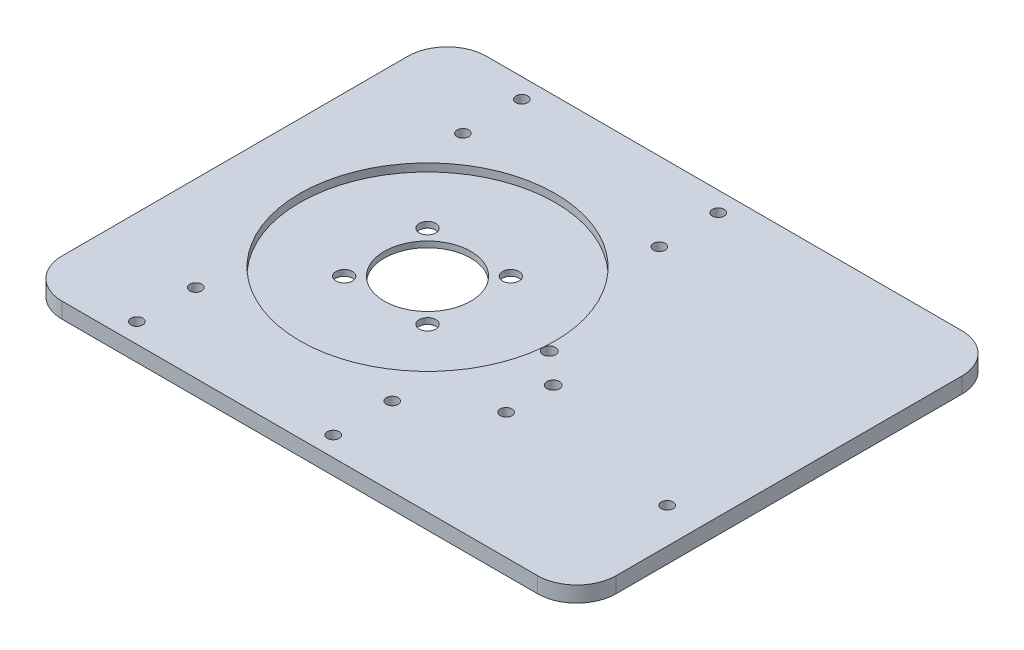
ISO-10303-21;
HEADER;
FILE_DESCRIPTION(('STEP AP214'),'2;1');
FILE_NAME('part.step','',(''),(''),'','','');
FILE_SCHEMA(('AUTOMOTIVE_DESIGN { 1 0 10303 214 1 1 1 1 }'));
ENDSEC;
DATA;
#1=APPLICATION_CONTEXT('core data for automotive mechanical design processes');
#2=APPLICATION_PROTOCOL_DEFINITION('international standard','automotive_design',2000,#1);
#3=PRODUCT_CONTEXT('',#1,'mechanical');
#4=PRODUCT('Part','Part','',(#3));
#5=PRODUCT_RELATED_PRODUCT_CATEGORY('part','',(#4));
#6=PRODUCT_DEFINITION_FORMATION('','',#4);
#7=PRODUCT_DEFINITION_CONTEXT('part definition',#1,'design');
#8=PRODUCT_DEFINITION('design','',#6,#7);
#9=PRODUCT_DEFINITION_SHAPE('','',#8);
#10=(LENGTH_UNIT() NAMED_UNIT(*) SI_UNIT(.MILLI.,.METRE.));
#11=(NAMED_UNIT(*) PLANE_ANGLE_UNIT() SI_UNIT($,.RADIAN.));
#12=(NAMED_UNIT(*) SI_UNIT($,.STERADIAN.) SOLID_ANGLE_UNIT());
#13=UNCERTAINTY_MEASURE_WITH_UNIT(LENGTH_MEASURE(1.E-05),#10,'distance_accuracy_value','');
#14=(GEOMETRIC_REPRESENTATION_CONTEXT(3) GLOBAL_UNCERTAINTY_ASSIGNED_CONTEXT((#13)) GLOBAL_UNIT_ASSIGNED_CONTEXT((#10,
#11,#12)) REPRESENTATION_CONTEXT('',''));
#15=CARTESIAN_POINT('',(0.,0.,0.));
#16=DIRECTION('',(0.,0.,1.));
#17=DIRECTION('',(1.,0.,0.));
#18=AXIS2_PLACEMENT_3D('',#15,#16,#17);
#19=CARTESIAN_POINT('',(237.616141789,-293.147680018,0.));
#20=DIRECTION('',(0.,1.,0.));
#21=DIRECTION('',(0.,0.,1.));
#22=AXIS2_PLACEMENT_3D('',#19,#20,#21);
#23=PLANE('',#22);
#24=CARTESIAN_POINT('',(237.616141789,-293.147680018,0.));
#25=DIRECTION('',(0.,1.,0.));
#26=DIRECTION('',(0.,0.,1.));
#27=AXIS2_PLACEMENT_3D('',#24,#25,#26);
#28=CIRCLE('',#27,11.);
#29=CARTESIAN_POINT('',(237.616141789,-293.147680018,11.));
#30=VERTEX_POINT('',#29);
#31=EDGE_CURVE('E237',#30,#30,#28,.F.);
#32=ORIENTED_EDGE('',*,*,#31,.T.);
#33=EDGE_LOOP('',(#32));
#34=FACE_BOUND('',#33,.T.);
#35=CARTESIAN_POINT('',(248.222743506798,-293.147680018,10.6066017177982));
#36=DIRECTION('',(0.,1.,0.));
#37=DIRECTION('',(0.,0.,1.));
#38=AXIS2_PLACEMENT_3D('',#35,#36,#37);
#39=CIRCLE('',#38,2.09999999999999);
#40=CARTESIAN_POINT('',(248.222743506798,-293.147680018,12.7066017177982));
#41=VERTEX_POINT('',#40);
#42=EDGE_CURVE('E240',#41,#41,#39,.F.);
#43=ORIENTED_EDGE('',*,*,#42,.T.);
#44=EDGE_LOOP('',(#43));
#45=FACE_BOUND('',#44,.T.);
#46=CARTESIAN_POINT('',(227.009540071202,-293.147680018,-10.6066017177981));
#47=DIRECTION('',(0.,1.,0.));
#48=DIRECTION('',(0.,0.,1.));
#49=AXIS2_PLACEMENT_3D('',#46,#47,#48);
#50=CIRCLE('',#49,2.09999999999999);
#51=CARTESIAN_POINT('',(227.009540071202,-293.147680018,-8.5066017177981));
#52=VERTEX_POINT('',#51);
#53=EDGE_CURVE('E243',#52,#52,#50,.F.);
#54=ORIENTED_EDGE('',*,*,#53,.T.);
#55=EDGE_LOOP('',(#54));
#56=FACE_BOUND('',#55,.T.);
#57=CARTESIAN_POINT('',(237.616141789,-293.147680018,0.));
#58=DIRECTION('',(0.,1.,0.));
#59=DIRECTION('',(0.,0.,1.));
#60=AXIS2_PLACEMENT_3D('',#57,#58,#59);
#61=CIRCLE('',#60,32.5);
#62=CARTESIAN_POINT('',(237.616141789,-293.147680018,32.5));
#63=VERTEX_POINT('',#62);
#64=EDGE_CURVE('E234',#63,#63,#61,.T.);
#65=ORIENTED_EDGE('',*,*,#64,.T.);
#66=EDGE_LOOP('',(#65));
#67=FACE_BOUND('',#66,.T.);
#68=CARTESIAN_POINT('',(248.222743506798,-293.147680018,-10.6066017177982));
#69=DIRECTION('',(0.,1.,0.));
#70=DIRECTION('',(0.,0.,1.));
#71=AXIS2_PLACEMENT_3D('',#68,#69,#70);
#72=CIRCLE('',#71,2.09999999999999);
#73=CARTESIAN_POINT('',(248.222743506798,-293.147680018,-8.50660171779822));
#74=VERTEX_POINT('',#73);
#75=EDGE_CURVE('E245',#74,#74,#72,.F.);
#76=ORIENTED_EDGE('',*,*,#75,.T.);
#77=EDGE_LOOP('',(#76));
#78=FACE_BOUND('',#77,.T.);
#79=CARTESIAN_POINT('',(227.009540071202,-293.147680018,10.6066017177982));
#80=DIRECTION('',(0.,1.,0.));
#81=DIRECTION('',(0.,0.,1.));
#82=AXIS2_PLACEMENT_3D('',#79,#80,#81);
#83=CIRCLE('',#82,2.09999999999999);
#84=CARTESIAN_POINT('',(227.009540071202,-293.147680018,12.7066017177982));
#85=VERTEX_POINT('',#84);
#86=EDGE_CURVE('E20',#85,#85,#83,.F.);
#87=ORIENTED_EDGE('',*,*,#86,.T.);
#88=EDGE_LOOP('',(#87));
#89=FACE_BOUND('',#88,.T.);
#90=ADVANCED_FACE('F17',(#34,#45,#56,#67,#78,#89),#23,.T.);
#91=CARTESIAN_POINT('',(227.009540071202,-302.147680018,10.6066017177982));
#92=DIRECTION('',(0.,1.,0.));
#93=DIRECTION('',(0.,0.,1.));
#94=AXIS2_PLACEMENT_3D('',#91,#92,#93);
#95=CYLINDRICAL_SURFACE('',#94,2.09999999999999);
#96=ORIENTED_EDGE('',*,*,#86,.F.);
#97=EDGE_LOOP('',(#96));
#98=FACE_BOUND('',#97,.T.);
#99=CARTESIAN_POINT('',(227.009540071202,-294.647680018,10.6066017177982));
#100=DIRECTION('',(0.,1.,0.));
#101=DIRECTION('',(0.,0.,1.));
#102=AXIS2_PLACEMENT_3D('',#99,#100,#101);
#103=CIRCLE('',#102,2.09999999999999);
#104=CARTESIAN_POINT('',(227.009540071202,-294.647680018,12.7066017177982));
#105=VERTEX_POINT('',#104);
#106=EDGE_CURVE('E231',#105,#105,#103,.T.);
#107=ORIENTED_EDGE('',*,*,#106,.F.);
#108=EDGE_LOOP('',(#107));
#109=FACE_BOUND('',#108,.T.);
#110=ADVANCED_FACE('F253',(#98,#109),#95,.F.);
#111=CARTESIAN_POINT('',(248.222743506798,-302.147680018,-10.6066017177982));
#112=DIRECTION('',(0.,1.,0.));
#113=DIRECTION('',(0.,0.,1.));
#114=AXIS2_PLACEMENT_3D('',#111,#112,#113);
#115=CYLINDRICAL_SURFACE('',#114,2.09999999999999);
#116=ORIENTED_EDGE('',*,*,#75,.F.);
#117=EDGE_LOOP('',(#116));
#118=FACE_BOUND('',#117,.T.);
#119=CARTESIAN_POINT('',(248.222743506798,-294.647680018,-10.6066017177982));
#120=DIRECTION('',(0.,1.,0.));
#121=DIRECTION('',(0.,0.,1.));
#122=AXIS2_PLACEMENT_3D('',#119,#120,#121);
#123=CIRCLE('',#122,2.09999999999999);
#124=CARTESIAN_POINT('',(248.222743506798,-294.647680018,-8.50660171779822));
#125=VERTEX_POINT('',#124);
#126=EDGE_CURVE('E228',#125,#125,#123,.T.);
#127=ORIENTED_EDGE('',*,*,#126,.F.);
#128=EDGE_LOOP('',(#127));
#129=FACE_BOUND('',#128,.T.);
#130=ADVANCED_FACE('F256',(#118,#129),#115,.F.);
#131=CARTESIAN_POINT('',(227.009540071202,-302.147680018,-10.6066017177981));
#132=DIRECTION('',(0.,1.,0.));
#133=DIRECTION('',(0.,0.,1.));
#134=AXIS2_PLACEMENT_3D('',#131,#132,#133);
#135=CYLINDRICAL_SURFACE('',#134,2.09999999999999);
#136=ORIENTED_EDGE('',*,*,#53,.F.);
#137=EDGE_LOOP('',(#136));
#138=FACE_BOUND('',#137,.T.);
#139=CARTESIAN_POINT('',(227.009540071202,-294.647680018,-10.6066017177981));
#140=DIRECTION('',(0.,1.,0.));
#141=DIRECTION('',(0.,0.,1.));
#142=AXIS2_PLACEMENT_3D('',#139,#140,#141);
#143=CIRCLE('',#142,2.09999999999999);
#144=CARTESIAN_POINT('',(227.009540071202,-294.647680018,-8.5066017177981));
#145=VERTEX_POINT('',#144);
#146=EDGE_CURVE('E225',#145,#145,#143,.T.);
#147=ORIENTED_EDGE('',*,*,#146,.F.);
#148=EDGE_LOOP('',(#147));
#149=FACE_BOUND('',#148,.T.);
#150=ADVANCED_FACE('F371',(#138,#149),#135,.F.);
#151=CARTESIAN_POINT('',(248.222743506798,-302.147680018,10.6066017177982));
#152=DIRECTION('',(0.,1.,0.));
#153=DIRECTION('',(0.,0.,1.));
#154=AXIS2_PLACEMENT_3D('',#151,#152,#153);
#155=CYLINDRICAL_SURFACE('',#154,2.09999999999999);
#156=ORIENTED_EDGE('',*,*,#42,.F.);
#157=EDGE_LOOP('',(#156));
#158=FACE_BOUND('',#157,.T.);
#159=CARTESIAN_POINT('',(248.222743506798,-294.647680018,10.6066017177982));
#160=DIRECTION('',(0.,1.,0.));
#161=DIRECTION('',(0.,0.,1.));
#162=AXIS2_PLACEMENT_3D('',#159,#160,#161);
#163=CIRCLE('',#162,2.09999999999999);
#164=CARTESIAN_POINT('',(248.222743506798,-294.647680018,12.7066017177982));
#165=VERTEX_POINT('',#164);
#166=EDGE_CURVE('E222',#165,#165,#163,.T.);
#167=ORIENTED_EDGE('',*,*,#166,.F.);
#168=EDGE_LOOP('',(#167));
#169=FACE_BOUND('',#168,.T.);
#170=ADVANCED_FACE('F377',(#158,#169),#155,.F.);
#171=CARTESIAN_POINT('',(237.616141789,-302.147680018,0.));
#172=DIRECTION('',(0.,1.,0.));
#173=DIRECTION('',(0.,0.,1.));
#174=AXIS2_PLACEMENT_3D('',#171,#172,#173);
#175=CYLINDRICAL_SURFACE('',#174,11.);
#176=ORIENTED_EDGE('',*,*,#31,.F.);
#177=EDGE_LOOP('',(#176));
#178=FACE_BOUND('',#177,.T.);
#179=CARTESIAN_POINT('',(237.616141789,-294.647680018,0.));
#180=DIRECTION('',(0.,1.,0.));
#181=DIRECTION('',(0.,0.,1.));
#182=AXIS2_PLACEMENT_3D('',#179,#180,#181);
#183=CIRCLE('',#182,11.);
#184=CARTESIAN_POINT('',(237.616141789,-294.647680018,11.));
#185=VERTEX_POINT('',#184);
#186=EDGE_CURVE('E219',#185,#185,#183,.T.);
#187=ORIENTED_EDGE('',*,*,#186,.F.);
#188=EDGE_LOOP('',(#187));
#189=FACE_BOUND('',#188,.T.);
#190=ADVANCED_FACE('F272',(#178,#189),#175,.F.);
#191=CARTESIAN_POINT('',(237.616141789,-293.147680018,0.));
#192=DIRECTION('',(0.,1.,0.));
#193=DIRECTION('',(0.,0.,1.));
#194=AXIS2_PLACEMENT_3D('',#191,#192,#193);
#195=CYLINDRICAL_SURFACE('',#194,32.5);
#196=CARTESIAN_POINT('',(237.616141789,-291.147680018,0.));
#197=DIRECTION('',(0.,1.,0.));
#198=DIRECTION('',(0.,0.,1.));
#199=AXIS2_PLACEMENT_3D('',#196,#197,#198);
#200=CIRCLE('',#199,32.5);
#201=CARTESIAN_POINT('',(237.616141789,-291.147680018,32.5));
#202=VERTEX_POINT('',#201);
#203=EDGE_CURVE('E216',#202,#202,#200,.F.);
#204=ORIENTED_EDGE('',*,*,#203,.F.);
#205=EDGE_LOOP('',(#204));
#206=FACE_BOUND('',#205,.T.);
#207=ORIENTED_EDGE('',*,*,#64,.F.);
#208=EDGE_LOOP('',(#207));
#209=FACE_BOUND('',#208,.T.);
#210=ADVANCED_FACE('F261',(#206,#209),#195,.F.);
#211=CARTESIAN_POINT('',(237.616141789023,-294.647680018,-3.56312201965636E-11));
#212=DIRECTION('',(0.,-1.,0.));
#213=DIRECTION('',(0.,0.,-1.));
#214=AXIS2_PLACEMENT_3D('',#211,#212,#213);
#215=PLANE('',#214);
#216=ORIENTED_EDGE('',*,*,#186,.T.);
#217=EDGE_LOOP('',(#216));
#218=FACE_BOUND('',#217,.T.);
#219=ORIENTED_EDGE('',*,*,#166,.T.);
#220=EDGE_LOOP('',(#219));
#221=FACE_BOUND('',#220,.T.);
#222=ORIENTED_EDGE('',*,*,#146,.T.);
#223=EDGE_LOOP('',(#222));
#224=FACE_BOUND('',#223,.T.);
#225=CARTESIAN_POINT('',(237.616141789023,-294.647680018,-3.56312201965636E-11));
#226=DIRECTION('',(0.,-1.,0.));
#227=DIRECTION('',(0.,0.,-1.));
#228=AXIS2_PLACEMENT_3D('',#225,#226,#227);
#229=CIRCLE('',#228,20.5);
#230=CARTESIAN_POINT('',(237.616141789023,-294.647680018,-20.5000000000357));
#231=VERTEX_POINT('',#230);
#232=EDGE_CURVE('E213',#231,#231,#229,.T.);
#233=ORIENTED_EDGE('',*,*,#232,.T.);
#234=EDGE_LOOP('',(#233));
#235=FACE_BOUND('',#234,.T.);
#236=ORIENTED_EDGE('',*,*,#126,.T.);
#237=EDGE_LOOP('',(#236));
#238=FACE_BOUND('',#237,.T.);
#239=ORIENTED_EDGE('',*,*,#106,.T.);
#240=EDGE_LOOP('',(#239));
#241=FACE_BOUND('',#240,.T.);
#242=ADVANCED_FACE('F259',(#218,#221,#224,#235,#238,#241),#215,.T.);
#243=CARTESIAN_POINT('',(198.616141789,-291.147680018,43.9999999999999));
#244=DIRECTION('',(0.,1.,0.));
#245=DIRECTION('',(0.,0.,1.));
#246=AXIS2_PLACEMENT_3D('',#243,#244,#245);
#247=PLANE('',#246);
#248=CARTESIAN_POINT('',(279.616141789,-291.147680018,22.));
#249=DIRECTION('',(0.,-1.,0.));
#250=DIRECTION('',(0.,0.,-1.));
#251=AXIS2_PLACEMENT_3D('',#248,#249,#250);
#252=CIRCLE('',#251,1.49999999999997);
#253=CARTESIAN_POINT('',(279.616141789,-291.147680018,20.5));
#254=VERTEX_POINT('',#253);
#255=EDGE_CURVE('E207',#254,#254,#252,.T.);
#256=ORIENTED_EDGE('',*,*,#255,.T.);
#257=EDGE_LOOP('',(#256));
#258=FACE_BOUND('',#257,.T.);
#259=CARTESIAN_POINT('',(279.616141789,-291.147680018,9.99999999999996));
#260=DIRECTION('',(0.,-1.,0.));
#261=DIRECTION('',(0.,0.,-1.));
#262=AXIS2_PLACEMENT_3D('',#259,#260,#261);
#263=CIRCLE('',#262,1.59999999999996);
#264=CARTESIAN_POINT('',(279.616141789,-291.147680018,8.4));
#265=VERTEX_POINT('',#264);
#266=EDGE_CURVE('E180',#265,#265,#263,.T.);
#267=ORIENTED_EDGE('',*,*,#266,.T.);
#268=EDGE_LOOP('',(#267));
#269=FACE_BOUND('',#268,.T.);
#270=CARTESIAN_POINT('',(262.616141789,-291.147680018,34.));
#271=DIRECTION('',(0.,-1.,0.));
#272=DIRECTION('',(0.,0.,-1.));
#273=AXIS2_PLACEMENT_3D('',#270,#271,#272);
#274=CIRCLE('',#273,1.50000000000002);
#275=CARTESIAN_POINT('',(262.616141789,-291.147680018,32.5));
#276=VERTEX_POINT('',#275);
#277=EDGE_CURVE('E198',#276,#276,#274,.T.);
#278=ORIENTED_EDGE('',*,*,#277,.T.);
#279=EDGE_LOOP('',(#278));
#280=FACE_BOUND('',#279,.T.);
#281=CARTESIAN_POINT('',(212.616141789,-291.147680018,49.));
#282=DIRECTION('',(0.,-1.,0.));
#283=DIRECTION('',(0.,0.,-1.));
#284=AXIS2_PLACEMENT_3D('',#281,#282,#283);
#285=CIRCLE('',#284,1.50000000000003);
#286=CARTESIAN_POINT('',(212.616141789,-291.147680018,47.5));
#287=VERTEX_POINT('',#286);
#288=EDGE_CURVE('E201',#287,#287,#285,.T.);
#289=ORIENTED_EDGE('',*,*,#288,.T.);
#290=EDGE_LOOP('',(#289));
#291=FACE_BOUND('',#290,.T.);
#292=CARTESIAN_POINT('',(262.616141789,-291.147680018,-34.));
#293=DIRECTION('',(0.,-1.,0.));
#294=DIRECTION('',(0.,0.,-1.));
#295=AXIS2_PLACEMENT_3D('',#292,#293,#294);
#296=CIRCLE('',#295,1.50000000000008);
#297=CARTESIAN_POINT('',(262.616141789,-291.147680018,-35.5000000000001));
#298=VERTEX_POINT('',#297);
#299=EDGE_CURVE('E189',#298,#298,#296,.T.);
#300=ORIENTED_EDGE('',*,*,#299,.T.);
#301=EDGE_LOOP('',(#300));
#302=FACE_BOUND('',#301,.T.);
#303=CARTESIAN_POINT('',(212.616141789,-291.147680018,-49.));
#304=DIRECTION('',(0.,-1.,0.));
#305=DIRECTION('',(0.,0.,-1.));
#306=AXIS2_PLACEMENT_3D('',#303,#304,#305);
#307=CIRCLE('',#306,1.50000000000003);
#308=CARTESIAN_POINT('',(212.616141789,-291.147680018,-50.5));
#309=VERTEX_POINT('',#308);
#310=EDGE_CURVE('E186',#309,#309,#307,.T.);
#311=ORIENTED_EDGE('',*,*,#310,.T.);
#312=EDGE_LOOP('',(#311));
#313=FACE_BOUND('',#312,.T.);
#314=CARTESIAN_POINT('',(198.616141789,-291.147680018,-44.));
#315=DIRECTION('',(0.,-1.,0.));
#316=DIRECTION('',(0.,0.,-1.));
#317=AXIS2_PLACEMENT_3D('',#314,#315,#316);
#318=CIRCLE('',#317,10.);
#319=CARTESIAN_POINT('',(188.616141789,-291.147680018,-44.));
#320=VERTEX_POINT('',#319);
#321=CARTESIAN_POINT('',(198.616141789,-291.147680018,-54.));
#322=VERTEX_POINT('',#321);
#323=EDGE_CURVE('E175',#320,#322,#318,.T.);
#324=ORIENTED_EDGE('',*,*,#323,.F.);
#325=DIRECTION('',(0.,0.,1.));
#326=VECTOR('',#325,1.);
#327=CARTESIAN_POINT('',(188.616141789,-291.147680018,53.9999999999999));
#328=LINE('',#327,#326);
#329=CARTESIAN_POINT('',(188.616141789,-291.147680018,43.9999999999999));
#330=VERTEX_POINT('',#329);
#331=EDGE_CURVE('E118',#330,#320,#328,.F.);
#332=ORIENTED_EDGE('',*,*,#331,.F.);
#333=CARTESIAN_POINT('',(198.616141789,-291.147680018,43.9999999999999));
#334=DIRECTION('',(0.,-1.,0.));
#335=DIRECTION('',(0.,0.,-1.));
#336=AXIS2_PLACEMENT_3D('',#333,#334,#335);
#337=CIRCLE('',#336,10.);
#338=CARTESIAN_POINT('',(198.616141789,-291.147680018,53.9999999999999));
#339=VERTEX_POINT('',#338);
#340=EDGE_CURVE('E99',#339,#330,#337,.T.);
#341=ORIENTED_EDGE('',*,*,#340,.F.);
#342=DIRECTION('',(1.,0.,0.));
#343=VECTOR('',#342,1.);
#344=CARTESIAN_POINT('',(207.616141789,-291.147680018,53.9999999999999));
#345=LINE('',#344,#343);
#346=CARTESIAN_POINT('',(319.616141789,-291.147680018,53.9999999999999));
#347=VERTEX_POINT('',#346);
#348=EDGE_CURVE('E94',#347,#339,#345,.F.);
#349=ORIENTED_EDGE('',*,*,#348,.F.);
#350=CARTESIAN_POINT('',(319.616141789,-291.147680018,43.9999999999999));
#351=DIRECTION('',(0.,-1.,0.));
#352=DIRECTION('',(0.,0.,-1.));
#353=AXIS2_PLACEMENT_3D('',#350,#351,#352);
#354=CIRCLE('',#353,10.);
#355=CARTESIAN_POINT('',(329.616141789,-291.147680018,43.9999999999999));
#356=VERTEX_POINT('',#355);
#357=EDGE_CURVE('E83',#356,#347,#354,.T.);
#358=ORIENTED_EDGE('',*,*,#357,.F.);
#359=DIRECTION('',(0.,0.,-1.));
#360=VECTOR('',#359,1.);
#361=CARTESIAN_POINT('',(329.616141789,-291.147680018,53.9999999999999));
#362=LINE('',#361,#360);
#363=CARTESIAN_POINT('',(329.616141789,-291.147680018,-44.));
#364=VERTEX_POINT('',#363);
#365=EDGE_CURVE('E78',#364,#356,#362,.F.);
#366=ORIENTED_EDGE('',*,*,#365,.F.);
#367=CARTESIAN_POINT('',(319.616141789,-291.147680018,-44.));
#368=DIRECTION('',(0.,-1.,0.));
#369=DIRECTION('',(0.,0.,-1.));
#370=AXIS2_PLACEMENT_3D('',#367,#368,#369);
#371=CIRCLE('',#370,10.);
#372=CARTESIAN_POINT('',(319.616141789,-291.147680018,-54.));
#373=VERTEX_POINT('',#372);
#374=EDGE_CURVE('E172',#373,#364,#371,.T.);
#375=ORIENTED_EDGE('',*,*,#374,.F.);
#376=DIRECTION('',(-1.,0.,0.));
#377=VECTOR('',#376,1.);
#378=CARTESIAN_POINT('',(207.616141789,-291.147680018,-54.));
#379=LINE('',#378,#377);
#380=EDGE_CURVE('E115',#322,#373,#379,.F.);
#381=ORIENTED_EDGE('',*,*,#380,.F.);
#382=EDGE_LOOP('',(#324,#332,#341,#349,#358,#366,#375,#381));
#383=FACE_BOUND('',#382,.T.);
#384=CARTESIAN_POINT('',(262.616141789,-291.147680018,-49.));
#385=DIRECTION('',(0.,-1.,0.));
#386=DIRECTION('',(0.,0.,-1.));
#387=AXIS2_PLACEMENT_3D('',#384,#385,#386);
#388=CIRCLE('',#387,1.50000000000008);
#389=CARTESIAN_POINT('',(262.616141789,-291.147680018,-50.5000000000001));
#390=VERTEX_POINT('',#389);
#391=EDGE_CURVE('E192',#390,#390,#388,.T.);
#392=ORIENTED_EDGE('',*,*,#391,.T.);
#393=EDGE_LOOP('',(#392));
#394=FACE_BOUND('',#393,.T.);
#395=CARTESIAN_POINT('',(212.616141789,-291.147680018,-34.));
#396=DIRECTION('',(0.,-1.,0.));
#397=DIRECTION('',(0.,0.,-1.));
#398=AXIS2_PLACEMENT_3D('',#395,#396,#397);
#399=CIRCLE('',#398,1.50000000000003);
#400=CARTESIAN_POINT('',(212.616141789,-291.147680018,-35.5));
#401=VERTEX_POINT('',#400);
#402=EDGE_CURVE('E183',#401,#401,#399,.T.);
#403=ORIENTED_EDGE('',*,*,#402,.T.);
#404=EDGE_LOOP('',(#403));
#405=FACE_BOUND('',#404,.T.);
#406=CARTESIAN_POINT('',(212.616141789,-291.147680018,34.));
#407=DIRECTION('',(0.,-1.,0.));
#408=DIRECTION('',(0.,0.,-1.));
#409=AXIS2_PLACEMENT_3D('',#406,#407,#408);
#410=CIRCLE('',#409,1.50000000000003);
#411=CARTESIAN_POINT('',(212.616141789,-291.147680018,32.5));
#412=VERTEX_POINT('',#411);
#413=EDGE_CURVE('E204',#412,#412,#410,.T.);
#414=ORIENTED_EDGE('',*,*,#413,.T.);
#415=EDGE_LOOP('',(#414));
#416=FACE_BOUND('',#415,.T.);
#417=CARTESIAN_POINT('',(262.616141789,-291.147680018,49.));
#418=DIRECTION('',(0.,-1.,0.));
#419=DIRECTION('',(0.,0.,-1.));
#420=AXIS2_PLACEMENT_3D('',#417,#418,#419);
#421=CIRCLE('',#420,1.50000000000002);
#422=CARTESIAN_POINT('',(262.616141789,-291.147680018,47.5));
#423=VERTEX_POINT('',#422);
#424=EDGE_CURVE('E195',#423,#423,#421,.T.);
#425=ORIENTED_EDGE('',*,*,#424,.T.);
#426=EDGE_LOOP('',(#425));
#427=FACE_BOUND('',#426,.T.);
#428=CARTESIAN_POINT('',(320.616141789,-291.147680018,22.));
#429=DIRECTION('',(0.,-1.,0.));
#430=DIRECTION('',(0.,0.,-1.));
#431=AXIS2_PLACEMENT_3D('',#428,#429,#430);
#432=CIRCLE('',#431,1.50000000000003);
#433=CARTESIAN_POINT('',(320.616141789,-291.147680018,20.5));
#434=VERTEX_POINT('',#433);
#435=EDGE_CURVE('E210',#434,#434,#432,.T.);
#436=ORIENTED_EDGE('',*,*,#435,.T.);
#437=EDGE_LOOP('',(#436));
#438=FACE_BOUND('',#437,.T.);
#439=CARTESIAN_POINT('',(271.616141789,-291.147680018,2.99999999999996));
#440=DIRECTION('',(0.,-1.,0.));
#441=DIRECTION('',(0.,0.,-1.));
#442=AXIS2_PLACEMENT_3D('',#439,#440,#441);
#443=CIRCLE('',#442,1.59999999999996);
#444=CARTESIAN_POINT('',(271.616141789,-291.147680018,1.39999999999999));
#445=VERTEX_POINT('',#444);
#446=EDGE_CURVE('E114',#445,#445,#443,.T.);
#447=ORIENTED_EDGE('',*,*,#446,.T.);
#448=EDGE_LOOP('',(#447));
#449=FACE_BOUND('',#448,.T.);
#450=ORIENTED_EDGE('',*,*,#203,.T.);
#451=EDGE_LOOP('',(#450));
#452=FACE_BOUND('',#451,.T.);
#453=ADVANCED_FACE('F96',(#258,#269,#280,#291,#302,#313,#383,#394,#405,#416,#427,#438,#449,
#452),#247,.T.);
#454=CARTESIAN_POINT('',(237.616141789023,-294.647680018,-3.56312201965636E-11));
#455=DIRECTION('',(0.,-1.,0.));
#456=DIRECTION('',(0.,0.,-1.));
#457=AXIS2_PLACEMENT_3D('',#454,#455,#456);
#458=CYLINDRICAL_SURFACE('',#457,20.5);
#459=CARTESIAN_POINT('',(237.616141789023,-295.147680018,-3.56312201965636E-11));
#460=DIRECTION('',(0.,-1.,0.));
#461=DIRECTION('',(0.,0.,-1.));
#462=AXIS2_PLACEMENT_3D('',#459,#460,#461);
#463=CIRCLE('',#462,20.5);
#464=CARTESIAN_POINT('',(237.616141789023,-295.147680018,-20.5000000000357));
#465=VERTEX_POINT('',#464);
#466=EDGE_CURVE('E168',#465,#465,#463,.F.);
#467=ORIENTED_EDGE('',*,*,#466,.F.);
#468=EDGE_LOOP('',(#467));
#469=FACE_BOUND('',#468,.T.);
#470=ORIENTED_EDGE('',*,*,#232,.F.);
#471=EDGE_LOOP('',(#470));
#472=FACE_BOUND('',#471,.T.);
#473=ADVANCED_FACE('F269',(#469,#472),#458,.F.);
#474=CARTESIAN_POINT('',(320.616141789,-285.147680018,22.));
#475=DIRECTION('',(0.,-1.,0.));
#476=DIRECTION('',(0.,0.,-1.));
#477=AXIS2_PLACEMENT_3D('',#474,#475,#476);
#478=CYLINDRICAL_SURFACE('',#477,1.50000000000003);
#479=CARTESIAN_POINT('',(320.616141789,-295.147680018,22.));
#480=DIRECTION('',(0.,-1.,0.));
#481=DIRECTION('',(0.,0.,-1.));
#482=AXIS2_PLACEMENT_3D('',#479,#480,#481);
#483=CIRCLE('',#482,1.50000000000003);
#484=CARTESIAN_POINT('',(320.616141789,-295.147680018,20.5));
#485=VERTEX_POINT('',#484);
#486=EDGE_CURVE('E165',#485,#485,#483,.F.);
#487=ORIENTED_EDGE('',*,*,#486,.F.);
#488=EDGE_LOOP('',(#487));
#489=FACE_BOUND('',#488,.T.);
#490=ORIENTED_EDGE('',*,*,#435,.F.);
#491=EDGE_LOOP('',(#490));
#492=FACE_BOUND('',#491,.T.);
#493=ADVANCED_FACE('F354',(#489,#492),#478,.F.);
#494=CARTESIAN_POINT('',(279.616141789,-285.147680018,22.));
#495=DIRECTION('',(0.,-1.,0.));
#496=DIRECTION('',(0.,0.,-1.));
#497=AXIS2_PLACEMENT_3D('',#494,#495,#496);
#498=CYLINDRICAL_SURFACE('',#497,1.49999999999997);
#499=CARTESIAN_POINT('',(279.616141789,-295.147680018,22.));
#500=DIRECTION('',(0.,-1.,0.));
#501=DIRECTION('',(0.,0.,-1.));
#502=AXIS2_PLACEMENT_3D('',#499,#500,#501);
#503=CIRCLE('',#502,1.49999999999997);
#504=CARTESIAN_POINT('',(279.616141789,-295.147680018,20.5));
#505=VERTEX_POINT('',#504);
#506=EDGE_CURVE('E162',#505,#505,#503,.F.);
#507=ORIENTED_EDGE('',*,*,#506,.F.);
#508=EDGE_LOOP('',(#507));
#509=FACE_BOUND('',#508,.T.);
#510=ORIENTED_EDGE('',*,*,#255,.F.);
#511=EDGE_LOOP('',(#510));
#512=FACE_BOUND('',#511,.T.);
#513=ADVANCED_FACE('F350',(#509,#512),#498,.F.);
#514=CARTESIAN_POINT('',(212.616141789,-285.147680018,34.));
#515=DIRECTION('',(0.,-1.,0.));
#516=DIRECTION('',(0.,0.,-1.));
#517=AXIS2_PLACEMENT_3D('',#514,#515,#516);
#518=CYLINDRICAL_SURFACE('',#517,1.50000000000003);
#519=CARTESIAN_POINT('',(212.616141789,-295.147680018,34.));
#520=DIRECTION('',(0.,-1.,0.));
#521=DIRECTION('',(0.,0.,-1.));
#522=AXIS2_PLACEMENT_3D('',#519,#520,#521);
#523=CIRCLE('',#522,1.50000000000003);
#524=CARTESIAN_POINT('',(212.616141789,-295.147680018,32.5));
#525=VERTEX_POINT('',#524);
#526=EDGE_CURVE('E159',#525,#525,#523,.F.);
#527=ORIENTED_EDGE('',*,*,#526,.F.);
#528=EDGE_LOOP('',(#527));
#529=FACE_BOUND('',#528,.T.);
#530=ORIENTED_EDGE('',*,*,#413,.F.);
#531=EDGE_LOOP('',(#530));
#532=FACE_BOUND('',#531,.T.);
#533=ADVANCED_FACE('F346',(#529,#532),#518,.F.);
#534=CARTESIAN_POINT('',(212.616141789,-285.147680018,49.));
#535=DIRECTION('',(0.,-1.,0.));
#536=DIRECTION('',(0.,0.,-1.));
#537=AXIS2_PLACEMENT_3D('',#534,#535,#536);
#538=CYLINDRICAL_SURFACE('',#537,1.50000000000003);
#539=CARTESIAN_POINT('',(212.616141789,-295.147680018,49.));
#540=DIRECTION('',(0.,-1.,0.));
#541=DIRECTION('',(0.,0.,-1.));
#542=AXIS2_PLACEMENT_3D('',#539,#540,#541);
#543=CIRCLE('',#542,1.50000000000003);
#544=CARTESIAN_POINT('',(212.616141789,-295.147680018,47.5));
#545=VERTEX_POINT('',#544);
#546=EDGE_CURVE('E156',#545,#545,#543,.F.);
#547=ORIENTED_EDGE('',*,*,#546,.F.);
#548=EDGE_LOOP('',(#547));
#549=FACE_BOUND('',#548,.T.);
#550=ORIENTED_EDGE('',*,*,#288,.F.);
#551=EDGE_LOOP('',(#550));
#552=FACE_BOUND('',#551,.T.);
#553=ADVANCED_FACE('F342',(#549,#552),#538,.F.);
#554=CARTESIAN_POINT('',(262.616141789,-285.147680018,34.));
#555=DIRECTION('',(0.,-1.,0.));
#556=DIRECTION('',(0.,0.,-1.));
#557=AXIS2_PLACEMENT_3D('',#554,#555,#556);
#558=CYLINDRICAL_SURFACE('',#557,1.50000000000002);
#559=CARTESIAN_POINT('',(262.616141789,-295.147680018,34.));
#560=DIRECTION('',(0.,-1.,0.));
#561=DIRECTION('',(0.,0.,-1.));
#562=AXIS2_PLACEMENT_3D('',#559,#560,#561);
#563=CIRCLE('',#562,1.50000000000002);
#564=CARTESIAN_POINT('',(262.616141789,-295.147680018,32.5));
#565=VERTEX_POINT('',#564);
#566=EDGE_CURVE('E153',#565,#565,#563,.F.);
#567=ORIENTED_EDGE('',*,*,#566,.F.);
#568=EDGE_LOOP('',(#567));
#569=FACE_BOUND('',#568,.T.);
#570=ORIENTED_EDGE('',*,*,#277,.F.);
#571=EDGE_LOOP('',(#570));
#572=FACE_BOUND('',#571,.T.);
#573=ADVANCED_FACE('F338',(#569,#572),#558,.F.);
#574=CARTESIAN_POINT('',(262.616141789,-285.147680018,49.));
#575=DIRECTION('',(0.,-1.,0.));
#576=DIRECTION('',(0.,0.,-1.));
#577=AXIS2_PLACEMENT_3D('',#574,#575,#576);
#578=CYLINDRICAL_SURFACE('',#577,1.50000000000002);
#579=CARTESIAN_POINT('',(262.616141789,-295.147680018,49.));
#580=DIRECTION('',(0.,-1.,0.));
#581=DIRECTION('',(0.,0.,-1.));
#582=AXIS2_PLACEMENT_3D('',#579,#580,#581);
#583=CIRCLE('',#582,1.50000000000002);
#584=CARTESIAN_POINT('',(262.616141789,-295.147680018,47.5));
#585=VERTEX_POINT('',#584);
#586=EDGE_CURVE('E150',#585,#585,#583,.F.);
#587=ORIENTED_EDGE('',*,*,#586,.F.);
#588=EDGE_LOOP('',(#587));
#589=FACE_BOUND('',#588,.T.);
#590=ORIENTED_EDGE('',*,*,#424,.F.);
#591=EDGE_LOOP('',(#590));
#592=FACE_BOUND('',#591,.T.);
#593=ADVANCED_FACE('F334',(#589,#592),#578,.F.);
#594=CARTESIAN_POINT('',(262.616141789,-285.147680018,-49.));
#595=DIRECTION('',(0.,-1.,0.));
#596=DIRECTION('',(0.,0.,-1.));
#597=AXIS2_PLACEMENT_3D('',#594,#595,#596);
#598=CYLINDRICAL_SURFACE('',#597,1.50000000000008);
#599=CARTESIAN_POINT('',(262.616141789,-295.147680018,-49.));
#600=DIRECTION('',(0.,-1.,0.));
#601=DIRECTION('',(0.,0.,-1.));
#602=AXIS2_PLACEMENT_3D('',#599,#600,#601);
#603=CIRCLE('',#602,1.50000000000008);
#604=CARTESIAN_POINT('',(262.616141789,-295.147680018,-50.5000000000001));
#605=VERTEX_POINT('',#604);
#606=EDGE_CURVE('E147',#605,#605,#603,.F.);
#607=ORIENTED_EDGE('',*,*,#606,.F.);
#608=EDGE_LOOP('',(#607));
#609=FACE_BOUND('',#608,.T.);
#610=ORIENTED_EDGE('',*,*,#391,.F.);
#611=EDGE_LOOP('',(#610));
#612=FACE_BOUND('',#611,.T.);
#613=ADVANCED_FACE('F330',(#609,#612),#598,.F.);
#614=CARTESIAN_POINT('',(262.616141789,-285.147680018,-34.));
#615=DIRECTION('',(0.,-1.,0.));
#616=DIRECTION('',(0.,0.,-1.));
#617=AXIS2_PLACEMENT_3D('',#614,#615,#616);
#618=CYLINDRICAL_SURFACE('',#617,1.50000000000008);
#619=CARTESIAN_POINT('',(262.616141789,-295.147680018,-34.));
#620=DIRECTION('',(0.,-1.,0.));
#621=DIRECTION('',(0.,0.,-1.));
#622=AXIS2_PLACEMENT_3D('',#619,#620,#621);
#623=CIRCLE('',#622,1.50000000000008);
#624=CARTESIAN_POINT('',(262.616141789,-295.147680018,-35.5000000000001));
#625=VERTEX_POINT('',#624);
#626=EDGE_CURVE('E144',#625,#625,#623,.F.);
#627=ORIENTED_EDGE('',*,*,#626,.F.);
#628=EDGE_LOOP('',(#627));
#629=FACE_BOUND('',#628,.T.);
#630=ORIENTED_EDGE('',*,*,#299,.F.);
#631=EDGE_LOOP('',(#630));
#632=FACE_BOUND('',#631,.T.);
#633=ADVANCED_FACE('F326',(#629,#632),#618,.F.);
#634=CARTESIAN_POINT('',(212.616141789,-285.147680018,-49.));
#635=DIRECTION('',(0.,-1.,0.));
#636=DIRECTION('',(0.,0.,-1.));
#637=AXIS2_PLACEMENT_3D('',#634,#635,#636);
#638=CYLINDRICAL_SURFACE('',#637,1.50000000000003);
#639=CARTESIAN_POINT('',(212.616141789,-295.147680018,-49.));
#640=DIRECTION('',(0.,-1.,0.));
#641=DIRECTION('',(0.,0.,-1.));
#642=AXIS2_PLACEMENT_3D('',#639,#640,#641);
#643=CIRCLE('',#642,1.50000000000003);
#644=CARTESIAN_POINT('',(212.616141789,-295.147680018,-50.5));
#645=VERTEX_POINT('',#644);
#646=EDGE_CURVE('E141',#645,#645,#643,.F.);
#647=ORIENTED_EDGE('',*,*,#646,.F.);
#648=EDGE_LOOP('',(#647));
#649=FACE_BOUND('',#648,.T.);
#650=ORIENTED_EDGE('',*,*,#310,.F.);
#651=EDGE_LOOP('',(#650));
#652=FACE_BOUND('',#651,.T.);
#653=ADVANCED_FACE('F322',(#649,#652),#638,.F.);
#654=CARTESIAN_POINT('',(212.616141789,-285.147680018,-34.));
#655=DIRECTION('',(0.,-1.,0.));
#656=DIRECTION('',(0.,0.,-1.));
#657=AXIS2_PLACEMENT_3D('',#654,#655,#656);
#658=CYLINDRICAL_SURFACE('',#657,1.50000000000003);
#659=CARTESIAN_POINT('',(212.616141789,-295.147680018,-34.));
#660=DIRECTION('',(0.,-1.,0.));
#661=DIRECTION('',(0.,0.,-1.));
#662=AXIS2_PLACEMENT_3D('',#659,#660,#661);
#663=CIRCLE('',#662,1.50000000000003);
#664=CARTESIAN_POINT('',(212.616141789,-295.147680018,-35.5));
#665=VERTEX_POINT('',#664);
#666=EDGE_CURVE('E138',#665,#665,#663,.F.);
#667=ORIENTED_EDGE('',*,*,#666,.F.);
#668=EDGE_LOOP('',(#667));
#669=FACE_BOUND('',#668,.T.);
#670=ORIENTED_EDGE('',*,*,#402,.F.);
#671=EDGE_LOOP('',(#670));
#672=FACE_BOUND('',#671,.T.);
#673=ADVANCED_FACE('F318',(#669,#672),#658,.F.);
#674=CARTESIAN_POINT('',(279.616141789,-285.147680018,9.99999999999996));
#675=DIRECTION('',(0.,-1.,0.));
#676=DIRECTION('',(0.,0.,-1.));
#677=AXIS2_PLACEMENT_3D('',#674,#675,#676);
#678=CYLINDRICAL_SURFACE('',#677,1.59999999999996);
#679=CARTESIAN_POINT('',(279.616141789,-295.147680018,9.99999999999996));
#680=DIRECTION('',(0.,-1.,0.));
#681=DIRECTION('',(0.,0.,-1.));
#682=AXIS2_PLACEMENT_3D('',#679,#680,#681);
#683=CIRCLE('',#682,1.59999999999996);
#684=CARTESIAN_POINT('',(279.616141789,-295.147680018,8.4));
#685=VERTEX_POINT('',#684);
#686=EDGE_CURVE('E135',#685,#685,#683,.F.);
#687=ORIENTED_EDGE('',*,*,#686,.F.);
#688=EDGE_LOOP('',(#687));
#689=FACE_BOUND('',#688,.T.);
#690=ORIENTED_EDGE('',*,*,#266,.F.);
#691=EDGE_LOOP('',(#690));
#692=FACE_BOUND('',#691,.T.);
#693=ADVANCED_FACE('F314',(#689,#692),#678,.F.);
#694=CARTESIAN_POINT('',(271.616141789,-285.147680018,2.99999999999996));
#695=DIRECTION('',(0.,-1.,0.));
#696=DIRECTION('',(0.,0.,-1.));
#697=AXIS2_PLACEMENT_3D('',#694,#695,#696);
#698=CYLINDRICAL_SURFACE('',#697,1.59999999999996);
#699=CARTESIAN_POINT('',(271.616141789,-295.147680018,2.99999999999996));
#700=DIRECTION('',(0.,-1.,0.));
#701=DIRECTION('',(0.,0.,-1.));
#702=AXIS2_PLACEMENT_3D('',#699,#700,#701);
#703=CIRCLE('',#702,1.59999999999996);
#704=CARTESIAN_POINT('',(271.616141789,-295.147680018,1.39999999999999));
#705=VERTEX_POINT('',#704);
#706=EDGE_CURVE('E132',#705,#705,#703,.F.);
#707=ORIENTED_EDGE('',*,*,#706,.F.);
#708=EDGE_LOOP('',(#707));
#709=FACE_BOUND('',#708,.T.);
#710=ORIENTED_EDGE('',*,*,#446,.F.);
#711=EDGE_LOOP('',(#710));
#712=FACE_BOUND('',#711,.T.);
#713=ADVANCED_FACE('F311',(#709,#712),#698,.F.);
#714=CARTESIAN_POINT('',(329.616141789,-292.147680018,53.9999999999999));
#715=DIRECTION('',(1.,0.,0.));
#716=DIRECTION('',(0.,0.,-1.));
#717=AXIS2_PLACEMENT_3D('',#714,#715,#716);
#718=PLANE('',#717);
#719=DIRECTION('',(0.,-1.,0.));
#720=VECTOR('',#719,1.);
#721=CARTESIAN_POINT('',(329.616141789,-292.147680018,43.9999999999999));
#722=LINE('',#721,#720);
#723=CARTESIAN_POINT('',(329.616141789,-295.147680018,43.9999999999999));
#724=VERTEX_POINT('',#723);
#725=EDGE_CURVE('E90',#724,#356,#722,.F.);
#726=ORIENTED_EDGE('',*,*,#725,.F.);
#727=DIRECTION('',(0.,0.,-1.));
#728=VECTOR('',#727,1.);
#729=CARTESIAN_POINT('',(329.616141789,-295.147680018,-80.));
#730=LINE('',#729,#728);
#731=CARTESIAN_POINT('',(329.616141789,-295.147680018,-44.));
#732=VERTEX_POINT('',#731);
#733=EDGE_CURVE('E131',#732,#724,#730,.F.);
#734=ORIENTED_EDGE('',*,*,#733,.F.);
#735=DIRECTION('',(0.,-1.,0.));
#736=VECTOR('',#735,1.);
#737=CARTESIAN_POINT('',(329.616141789,-285.147680018,-44.));
#738=LINE('',#737,#736);
#739=EDGE_CURVE('E171',#364,#732,#738,.T.);
#740=ORIENTED_EDGE('',*,*,#739,.F.);
#741=ORIENTED_EDGE('',*,*,#365,.T.);
#742=EDGE_LOOP('',(#726,#734,#740,#741));
#743=FACE_BOUND('',#742,.T.);
#744=ADVANCED_FACE('F308',(#743),#718,.T.);
#745=CARTESIAN_POINT('',(319.616141789,-292.147680018,43.9999999999999));
#746=DIRECTION('',(0.,-1.,0.));
#747=DIRECTION('',(0.,0.,-1.));
#748=AXIS2_PLACEMENT_3D('',#745,#746,#747);
#749=CYLINDRICAL_SURFACE('',#748,10.);
#750=DIRECTION('',(0.,1.,0.));
#751=VECTOR('',#750,1.);
#752=CARTESIAN_POINT('',(319.616141789,-285.147680018,53.9999999999999));
#753=LINE('',#752,#751);
#754=CARTESIAN_POINT('',(319.616141789,-295.147680018,53.9999999999999));
#755=VERTEX_POINT('',#754);
#756=EDGE_CURVE('E88',#755,#347,#753,.T.);
#757=ORIENTED_EDGE('',*,*,#756,.F.);
#758=CARTESIAN_POINT('',(319.616141789,-295.147680018,43.9999999999999));
#759=DIRECTION('',(0.,-1.,0.));
#760=DIRECTION('',(0.,0.,-1.));
#761=AXIS2_PLACEMENT_3D('',#758,#759,#760);
#762=CIRCLE('',#761,10.);
#763=EDGE_CURVE('E129',#724,#755,#762,.T.);
#764=ORIENTED_EDGE('',*,*,#763,.F.);
#765=ORIENTED_EDGE('',*,*,#725,.T.);
#766=ORIENTED_EDGE('',*,*,#357,.T.);
#767=EDGE_LOOP('',(#757,#764,#765,#766));
#768=FACE_BOUND('',#767,.T.);
#769=ADVANCED_FACE('F85',(#768),#749,.T.);
#770=CARTESIAN_POINT('',(207.616141789,-285.147680018,53.9999999999999));
#771=DIRECTION('',(0.,0.,1.));
#772=DIRECTION('',(1.,0.,0.));
#773=AXIS2_PLACEMENT_3D('',#770,#771,#772);
#774=PLANE('',#773);
#775=ORIENTED_EDGE('',*,*,#348,.T.);
#776=DIRECTION('',(0.,-1.,0.));
#777=VECTOR('',#776,1.);
#778=CARTESIAN_POINT('',(198.616141789,-285.147680018,53.9999999999999));
#779=LINE('',#778,#777);
#780=CARTESIAN_POINT('',(198.616141789,-295.147680018,53.9999999999999));
#781=VERTEX_POINT('',#780);
#782=EDGE_CURVE('E102',#781,#339,#779,.F.);
#783=ORIENTED_EDGE('',*,*,#782,.F.);
#784=DIRECTION('',(1.,0.,0.));
#785=VECTOR('',#784,1.);
#786=CARTESIAN_POINT('',(207.616141789,-295.147680018,53.9999999999999));
#787=LINE('',#786,#785);
#788=EDGE_CURVE('E106',#755,#781,#787,.F.);
#789=ORIENTED_EDGE('',*,*,#788,.F.);
#790=ORIENTED_EDGE('',*,*,#756,.T.);
#791=EDGE_LOOP('',(#775,#783,#789,#790));
#792=FACE_BOUND('',#791,.T.);
#793=ADVANCED_FACE('F104',(#792),#774,.T.);
#794=CARTESIAN_POINT('',(198.616141789,-285.147680018,43.9999999999999));
#795=DIRECTION('',(0.,-1.,0.));
#796=DIRECTION('',(0.,0.,-1.));
#797=AXIS2_PLACEMENT_3D('',#794,#795,#796);
#798=CYLINDRICAL_SURFACE('',#797,10.);
#799=DIRECTION('',(0.,1.,0.));
#800=VECTOR('',#799,1.);
#801=CARTESIAN_POINT('',(188.616141789,-292.147680018,43.9999999999999));
#802=LINE('',#801,#800);
#803=CARTESIAN_POINT('',(188.616141789,-295.147680018,43.9999999999999));
#804=VERTEX_POINT('',#803);
#805=EDGE_CURVE('E120',#804,#330,#802,.T.);
#806=ORIENTED_EDGE('',*,*,#805,.F.);
#807=CARTESIAN_POINT('',(198.616141789,-295.147680018,43.9999999999999));
#808=DIRECTION('',(0.,-1.,0.));
#809=DIRECTION('',(0.,0.,-1.));
#810=AXIS2_PLACEMENT_3D('',#807,#808,#809);
#811=CIRCLE('',#810,10.);
#812=EDGE_CURVE('E126',#781,#804,#811,.T.);
#813=ORIENTED_EDGE('',*,*,#812,.F.);
#814=ORIENTED_EDGE('',*,*,#782,.T.);
#815=ORIENTED_EDGE('',*,*,#340,.T.);
#816=EDGE_LOOP('',(#806,#813,#814,#815));
#817=FACE_BOUND('',#816,.T.);
#818=ADVANCED_FACE('F299',(#817),#798,.T.);
#819=CARTESIAN_POINT('',(188.616141789,-292.147680018,53.9999999999999));
#820=DIRECTION('',(-1.,0.,0.));
#821=DIRECTION('',(0.,0.,1.));
#822=AXIS2_PLACEMENT_3D('',#819,#820,#821);
#823=PLANE('',#822);
#824=ORIENTED_EDGE('',*,*,#331,.T.);
#825=DIRECTION('',(0.,-1.,0.));
#826=VECTOR('',#825,1.);
#827=CARTESIAN_POINT('',(188.616141789,-292.147680018,-44.));
#828=LINE('',#827,#826);
#829=CARTESIAN_POINT('',(188.616141789,-295.147680018,-44.));
#830=VERTEX_POINT('',#829);
#831=EDGE_CURVE('E119',#830,#320,#828,.F.);
#832=ORIENTED_EDGE('',*,*,#831,.F.);
#833=DIRECTION('',(0.,0.,-1.));
#834=VECTOR('',#833,1.);
#835=CARTESIAN_POINT('',(188.616141789,-295.147680018,-80.));
#836=LINE('',#835,#834);
#837=EDGE_CURVE('E125',#804,#830,#836,.T.);
#838=ORIENTED_EDGE('',*,*,#837,.F.);
#839=ORIENTED_EDGE('',*,*,#805,.T.);
#840=EDGE_LOOP('',(#824,#832,#838,#839));
#841=FACE_BOUND('',#840,.T.);
#842=ADVANCED_FACE('F295',(#841),#823,.T.);
#843=CARTESIAN_POINT('',(198.616141789,-292.147680018,-44.));
#844=DIRECTION('',(0.,-1.,0.));
#845=DIRECTION('',(0.,0.,-1.));
#846=AXIS2_PLACEMENT_3D('',#843,#844,#845);
#847=CYLINDRICAL_SURFACE('',#846,10.);
#848=DIRECTION('',(0.,1.,0.));
#849=VECTOR('',#848,1.);
#850=CARTESIAN_POINT('',(198.616141789,-285.147680018,-54.));
#851=LINE('',#850,#849);
#852=CARTESIAN_POINT('',(198.616141789,-295.147680018,-54.));
#853=VERTEX_POINT('',#852);
#854=EDGE_CURVE('E117',#853,#322,#851,.T.);
#855=ORIENTED_EDGE('',*,*,#854,.F.);
#856=CARTESIAN_POINT('',(198.616141789,-295.147680018,-44.));
#857=DIRECTION('',(0.,-1.,0.));
#858=DIRECTION('',(0.,0.,-1.));
#859=AXIS2_PLACEMENT_3D('',#856,#857,#858);
#860=CIRCLE('',#859,10.);
#861=EDGE_CURVE('E122',#830,#853,#860,.T.);
#862=ORIENTED_EDGE('',*,*,#861,.F.);
#863=ORIENTED_EDGE('',*,*,#831,.T.);
#864=ORIENTED_EDGE('',*,*,#323,.T.);
#865=EDGE_LOOP('',(#855,#862,#863,#864));
#866=FACE_BOUND('',#865,.T.);
#867=ADVANCED_FACE('F292',(#866),#847,.T.);
#868=CARTESIAN_POINT('',(207.616141789,-285.147680018,-54.));
#869=DIRECTION('',(0.,0.,-1.));
#870=DIRECTION('',(-1.,0.,0.));
#871=AXIS2_PLACEMENT_3D('',#868,#869,#870);
#872=PLANE('',#871);
#873=DIRECTION('',(0.,-1.,0.));
#874=VECTOR('',#873,1.);
#875=CARTESIAN_POINT('',(319.616141789,-285.147680018,-54.));
#876=LINE('',#875,#874);
#877=CARTESIAN_POINT('',(319.616141789,-295.147680018,-54.));
#878=VERTEX_POINT('',#877);
#879=EDGE_CURVE('E35',#878,#373,#876,.F.);
#880=ORIENTED_EDGE('',*,*,#879,.F.);
#881=DIRECTION('',(1.,0.,0.));
#882=VECTOR('',#881,1.);
#883=CARTESIAN_POINT('',(207.616141789,-295.147680018,-54.));
#884=LINE('',#883,#882);
#885=EDGE_CURVE('E26',#853,#878,#884,.T.);
#886=ORIENTED_EDGE('',*,*,#885,.F.);
#887=ORIENTED_EDGE('',*,*,#854,.T.);
#888=ORIENTED_EDGE('',*,*,#380,.T.);
#889=EDGE_LOOP('',(#880,#886,#887,#888));
#890=FACE_BOUND('',#889,.T.);
#891=ADVANCED_FACE('F284',(#890),#872,.T.);
#892=CARTESIAN_POINT('',(319.616141789,-285.147680018,-44.));
#893=DIRECTION('',(0.,-1.,0.));
#894=DIRECTION('',(0.,0.,-1.));
#895=AXIS2_PLACEMENT_3D('',#892,#893,#894);
#896=CYLINDRICAL_SURFACE('',#895,10.);
#897=ORIENTED_EDGE('',*,*,#739,.T.);
#898=CARTESIAN_POINT('',(319.616141789,-295.147680018,-44.));
#899=DIRECTION('',(0.,-1.,0.));
#900=DIRECTION('',(0.,0.,-1.));
#901=AXIS2_PLACEMENT_3D('',#898,#899,#900);
#902=CIRCLE('',#901,10.);
#903=EDGE_CURVE('E11',#878,#732,#902,.T.);
#904=ORIENTED_EDGE('',*,*,#903,.F.);
#905=ORIENTED_EDGE('',*,*,#879,.T.);
#906=ORIENTED_EDGE('',*,*,#374,.T.);
#907=EDGE_LOOP('',(#897,#904,#905,#906));
#908=FACE_BOUND('',#907,.T.);
#909=ADVANCED_FACE('F278',(#908),#896,.T.);
#910=CARTESIAN_POINT('',(207.616141789,-295.147680018,-80.));
#911=DIRECTION('',(0.,-1.,0.));
#912=DIRECTION('',(0.,0.,-1.));
#913=AXIS2_PLACEMENT_3D('',#910,#911,#912);
#914=PLANE('',#913);
#915=ORIENTED_EDGE('',*,*,#885,.T.);
#916=ORIENTED_EDGE('',*,*,#903,.T.);
#917=ORIENTED_EDGE('',*,*,#733,.T.);
#918=ORIENTED_EDGE('',*,*,#763,.T.);
#919=ORIENTED_EDGE('',*,*,#788,.T.);
#920=ORIENTED_EDGE('',*,*,#812,.T.);
#921=ORIENTED_EDGE('',*,*,#837,.T.);
#922=ORIENTED_EDGE('',*,*,#861,.T.);
#923=EDGE_LOOP('',(#915,#916,#917,#918,#919,#920,#921,#922));
#924=FACE_BOUND('',#923,.T.);
#925=ORIENTED_EDGE('',*,*,#706,.T.);
#926=EDGE_LOOP('',(#925));
#927=FACE_BOUND('',#926,.T.);
#928=ORIENTED_EDGE('',*,*,#686,.T.);
#929=EDGE_LOOP('',(#928));
#930=FACE_BOUND('',#929,.T.);
#931=ORIENTED_EDGE('',*,*,#666,.T.);
#932=EDGE_LOOP('',(#931));
#933=FACE_BOUND('',#932,.T.);
#934=ORIENTED_EDGE('',*,*,#646,.T.);
#935=EDGE_LOOP('',(#934));
#936=FACE_BOUND('',#935,.T.);
#937=ORIENTED_EDGE('',*,*,#626,.T.);
#938=EDGE_LOOP('',(#937));
#939=FACE_BOUND('',#938,.T.);
#940=ORIENTED_EDGE('',*,*,#606,.T.);
#941=EDGE_LOOP('',(#940));
#942=FACE_BOUND('',#941,.T.);
#943=ORIENTED_EDGE('',*,*,#586,.T.);
#944=EDGE_LOOP('',(#943));
#945=FACE_BOUND('',#944,.T.);
#946=ORIENTED_EDGE('',*,*,#566,.T.);
#947=EDGE_LOOP('',(#946));
#948=FACE_BOUND('',#947,.T.);
#949=ORIENTED_EDGE('',*,*,#546,.T.);
#950=EDGE_LOOP('',(#949));
#951=FACE_BOUND('',#950,.T.);
#952=ORIENTED_EDGE('',*,*,#526,.T.);
#953=EDGE_LOOP('',(#952));
#954=FACE_BOUND('',#953,.T.);
#955=ORIENTED_EDGE('',*,*,#506,.T.);
#956=EDGE_LOOP('',(#955));
#957=FACE_BOUND('',#956,.T.);
#958=ORIENTED_EDGE('',*,*,#486,.T.);
#959=EDGE_LOOP('',(#958));
#960=FACE_BOUND('',#959,.T.);
#961=ORIENTED_EDGE('',*,*,#466,.T.);
#962=EDGE_LOOP('',(#961));
#963=FACE_BOUND('',#962,.T.);
#964=ADVANCED_FACE('F276',(#924,#927,#930,#933,#936,#939,#942,#945,#948,#951,#954,#957,#960,
#963),#914,.T.);
#965=CLOSED_SHELL('',(#90,#110,#130,#150,#170,#190,#210,#242,#453,#473,#493,#513,#533,#553,#573,
#593,#613,#633,#653,#673,#693,#713,#744,#769,#793,#818,#842,#867,#891,#909,#964));
#966=MANIFOLD_SOLID_BREP('B1',#965);
#967=ADVANCED_BREP_SHAPE_REPRESENTATION('',(#18,#966),#14);
#968=SHAPE_DEFINITION_REPRESENTATION(#9,#967);
ENDSEC;
END-ISO-10303-21;
